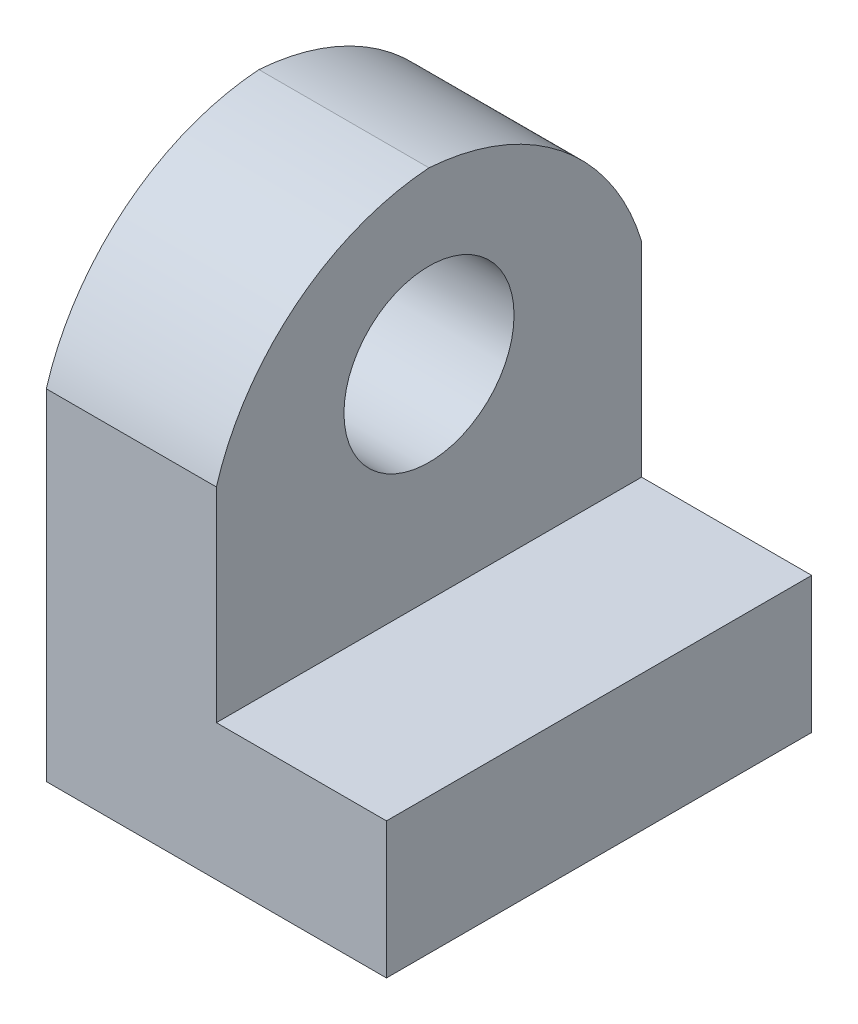
ISO-10303-21;
HEADER;
FILE_DESCRIPTION(('STEP AP214'),'2;1');
FILE_NAME('part.step','',(''),(''),'','','');
FILE_SCHEMA(('AUTOMOTIVE_DESIGN { 1 0 10303 214 1 1 1 1 }'));
ENDSEC;
DATA;
#1=APPLICATION_CONTEXT('core data for automotive mechanical design processes');
#2=APPLICATION_PROTOCOL_DEFINITION('international standard','automotive_design',2000,#1);
#3=PRODUCT_CONTEXT('',#1,'mechanical');
#4=PRODUCT('Part','Part','',(#3));
#5=PRODUCT_RELATED_PRODUCT_CATEGORY('part','',(#4));
#6=PRODUCT_DEFINITION_FORMATION('','',#4);
#7=PRODUCT_DEFINITION_CONTEXT('part definition',#1,'design');
#8=PRODUCT_DEFINITION('design','',#6,#7);
#9=PRODUCT_DEFINITION_SHAPE('','',#8);
#10=(LENGTH_UNIT() NAMED_UNIT(*) SI_UNIT(.MILLI.,.METRE.));
#11=(NAMED_UNIT(*) PLANE_ANGLE_UNIT() SI_UNIT($,.RADIAN.));
#12=(NAMED_UNIT(*) SI_UNIT($,.STERADIAN.) SOLID_ANGLE_UNIT());
#13=UNCERTAINTY_MEASURE_WITH_UNIT(LENGTH_MEASURE(1.E-05),#10,'distance_accuracy_value','');
#14=(GEOMETRIC_REPRESENTATION_CONTEXT(3) GLOBAL_UNCERTAINTY_ASSIGNED_CONTEXT((#13)) GLOBAL_UNIT_ASSIGNED_CONTEXT((#10,
#11,#12)) REPRESENTATION_CONTEXT('',''));
#15=CARTESIAN_POINT('',(0.,0.,0.));
#16=DIRECTION('',(0.,0.,1.));
#17=DIRECTION('',(1.,0.,0.));
#18=AXIS2_PLACEMENT_3D('',#15,#16,#17);
#19=CARTESIAN_POINT('',(0.,30.,0.));
#20=DIRECTION('',(1.,0.,0.));
#21=DIRECTION('',(0.,0.,-1.));
#22=AXIS2_PLACEMENT_3D('',#19,#20,#21);
#23=PLANE('',#22);
#24=CARTESIAN_POINT('',(0.,20.,12.5));
#25=DIRECTION('',(1.,0.,0.));
#26=DIRECTION('',(0.,0.,-1.));
#27=AXIS2_PLACEMENT_3D('',#24,#25,#26);
#28=CIRCLE('',#27,5.);
#29=CARTESIAN_POINT('',(0.,20.,7.5));
#30=VERTEX_POINT('',#29);
#31=EDGE_CURVE('E118',#30,#30,#28,.T.);
#32=ORIENTED_EDGE('',*,*,#31,.T.);
#33=EDGE_LOOP('',(#32));
#34=FACE_BOUND('',#33,.T.);
#35=CARTESIAN_POINT('',(0.,15.951031378761,11.5108251030088));
#36=DIRECTION('',(1.,0.,0.));
#37=DIRECTION('',(0.,0.,-1.));
#38=AXIS2_PLACEMENT_3D('',#35,#36,#37);
#39=CIRCLE('',#38,14.0837490142858);
#40=CARTESIAN_POINT('',(0.,30.,12.5));
#41=VERTEX_POINT('',#40);
#42=CARTESIAN_POINT('',(0.,20.,25.));
#43=VERTEX_POINT('',#42);
#44=EDGE_CURVE('E128',#41,#43,#39,.T.);
#45=ORIENTED_EDGE('',*,*,#44,.F.);
#46=CARTESIAN_POINT('',(0.,15.951031378761,13.4891748969912));
#47=DIRECTION('',(1.,0.,0.));
#48=DIRECTION('',(0.,0.,-1.));
#49=AXIS2_PLACEMENT_3D('',#46,#47,#48);
#50=CIRCLE('',#49,14.0837490142858);
#51=CARTESIAN_POINT('',(0.,20.,0.));
#52=VERTEX_POINT('',#51);
#53=EDGE_CURVE('E105',#41,#52,#50,.F.);
#54=ORIENTED_EDGE('',*,*,#53,.T.);
#55=DIRECTION('',(0.,-1.,0.));
#56=VECTOR('',#55,1.);
#57=CARTESIAN_POINT('',(0.,30.,0.));
#58=LINE('',#57,#56);
#59=CARTESIAN_POINT('',(0.,0.,0.));
#60=VERTEX_POINT('',#59);
#61=EDGE_CURVE('E62',#52,#60,#58,.T.);
#62=ORIENTED_EDGE('',*,*,#61,.T.);
#63=DIRECTION('',(0.,0.,1.));
#64=VECTOR('',#63,1.);
#65=CARTESIAN_POINT('',(0.,0.,0.));
#66=LINE('',#65,#64);
#67=CARTESIAN_POINT('',(0.,0.,25.));
#68=VERTEX_POINT('',#67);
#69=EDGE_CURVE('E148',#60,#68,#66,.T.);
#70=ORIENTED_EDGE('',*,*,#69,.T.);
#71=DIRECTION('',(0.,-1.,0.));
#72=VECTOR('',#71,1.);
#73=CARTESIAN_POINT('',(0.,30.,25.));
#74=LINE('',#73,#72);
#75=EDGE_CURVE('E47',#43,#68,#74,.T.);
#76=ORIENTED_EDGE('',*,*,#75,.F.);
#77=EDGE_LOOP('',(#45,#54,#62,#70,#76));
#78=FACE_BOUND('',#77,.T.);
#79=ADVANCED_FACE('F39',(#34,#78),#23,.F.);
#80=CARTESIAN_POINT('',(10.,8.,-5.));
#81=DIRECTION('',(-1.,0.,0.));
#82=DIRECTION('',(0.,0.,1.));
#83=AXIS2_PLACEMENT_3D('',#80,#81,#82);
#84=PLANE('',#83);
#85=CARTESIAN_POINT('',(10.,20.,12.5));
#86=DIRECTION('',(1.,0.,0.));
#87=DIRECTION('',(0.,0.,-1.));
#88=AXIS2_PLACEMENT_3D('',#85,#86,#87);
#89=CIRCLE('',#88,5.);
#90=CARTESIAN_POINT('',(10.,20.,7.5));
#91=VERTEX_POINT('',#90);
#92=EDGE_CURVE('E191',#91,#91,#89,.T.);
#93=ORIENTED_EDGE('',*,*,#92,.F.);
#94=EDGE_LOOP('',(#93));
#95=FACE_BOUND('',#94,.T.);
#96=DIRECTION('',(0.,-1.,0.));
#97=VECTOR('',#96,1.);
#98=CARTESIAN_POINT('',(10.,30.,0.));
#99=LINE('',#98,#97);
#100=CARTESIAN_POINT('',(10.,20.,0.));
#101=VERTEX_POINT('',#100);
#102=CARTESIAN_POINT('',(10.,8.,0.));
#103=VERTEX_POINT('',#102);
#104=EDGE_CURVE('E115',#101,#103,#99,.T.);
#105=ORIENTED_EDGE('',*,*,#104,.F.);
#106=CARTESIAN_POINT('',(10.,15.951031378761,13.4891748969912));
#107=DIRECTION('',(1.,0.,0.));
#108=DIRECTION('',(0.,0.,-1.));
#109=AXIS2_PLACEMENT_3D('',#106,#107,#108);
#110=CIRCLE('',#109,14.0837490142858);
#111=CARTESIAN_POINT('',(10.,30.,12.5));
#112=VERTEX_POINT('',#111);
#113=EDGE_CURVE('E103',#112,#101,#110,.F.);
#114=ORIENTED_EDGE('',*,*,#113,.F.);
#115=CARTESIAN_POINT('',(10.,15.951031378761,11.5108251030088));
#116=DIRECTION('',(1.,0.,0.));
#117=DIRECTION('',(0.,0.,-1.));
#118=AXIS2_PLACEMENT_3D('',#115,#116,#117);
#119=CIRCLE('',#118,14.0837490142858);
#120=CARTESIAN_POINT('',(10.,20.,25.));
#121=VERTEX_POINT('',#120);
#122=EDGE_CURVE('E108',#112,#121,#119,.T.);
#123=ORIENTED_EDGE('',*,*,#122,.T.);
#124=DIRECTION('',(0.,-1.,0.));
#125=VECTOR('',#124,1.);
#126=CARTESIAN_POINT('',(10.,8.,25.));
#127=LINE('',#126,#125);
#128=CARTESIAN_POINT('',(10.,8.,25.));
#129=VERTEX_POINT('',#128);
#130=EDGE_CURVE('E132',#121,#129,#127,.T.);
#131=ORIENTED_EDGE('',*,*,#130,.T.);
#132=DIRECTION('',(0.,0.,1.));
#133=VECTOR('',#132,1.);
#134=CARTESIAN_POINT('',(10.,8.,-5.));
#135=LINE('',#134,#133);
#136=EDGE_CURVE('E138',#103,#129,#135,.T.);
#137=ORIENTED_EDGE('',*,*,#136,.F.);
#138=EDGE_LOOP('',(#105,#114,#123,#131,#137));
#139=FACE_BOUND('',#138,.T.);
#140=ADVANCED_FACE('F112',(#95,#139),#84,.F.);
#141=CARTESIAN_POINT('',(0.,30.,25.));
#142=DIRECTION('',(0.,0.,-1.));
#143=DIRECTION('',(-1.,0.,0.));
#144=AXIS2_PLACEMENT_3D('',#141,#142,#143);
#145=PLANE('',#144);
#146=DIRECTION('',(1.,0.,0.));
#147=VECTOR('',#146,1.);
#148=CARTESIAN_POINT('',(-20.,20.,25.));
#149=LINE('',#148,#147);
#150=EDGE_CURVE('E54',#43,#121,#149,.T.);
#151=ORIENTED_EDGE('',*,*,#150,.F.);
#152=ORIENTED_EDGE('',*,*,#75,.T.);
#153=DIRECTION('',(1.,0.,0.));
#154=VECTOR('',#153,1.);
#155=CARTESIAN_POINT('',(0.,0.,25.));
#156=LINE('',#155,#154);
#157=CARTESIAN_POINT('',(20.,0.,25.));
#158=VERTEX_POINT('',#157);
#159=EDGE_CURVE('E151',#68,#158,#156,.T.);
#160=ORIENTED_EDGE('',*,*,#159,.T.);
#161=DIRECTION('',(0.,-1.,0.));
#162=VECTOR('',#161,1.);
#163=CARTESIAN_POINT('',(20.,30.,25.));
#164=LINE('',#163,#162);
#165=CARTESIAN_POINT('',(20.,8.,25.));
#166=VERTEX_POINT('',#165);
#167=EDGE_CURVE('E167',#166,#158,#164,.T.);
#168=ORIENTED_EDGE('',*,*,#167,.F.);
#169=DIRECTION('',(1.,0.,0.));
#170=VECTOR('',#169,1.);
#171=CARTESIAN_POINT('',(20.,8.,25.));
#172=LINE('',#171,#170);
#173=EDGE_CURVE('E135',#129,#166,#172,.T.);
#174=ORIENTED_EDGE('',*,*,#173,.F.);
#175=ORIENTED_EDGE('',*,*,#130,.F.);
#176=EDGE_LOOP('',(#151,#152,#160,#168,#174,#175));
#177=FACE_BOUND('',#176,.T.);
#178=ADVANCED_FACE('F173',(#177),#145,.F.);
#179=CARTESIAN_POINT('',(20.,30.,0.));
#180=DIRECTION('',(-1.,0.,0.));
#181=DIRECTION('',(0.,0.,1.));
#182=AXIS2_PLACEMENT_3D('',#179,#180,#181);
#183=PLANE('',#182);
#184=DIRECTION('',(0.,-1.,0.));
#185=VECTOR('',#184,1.);
#186=CARTESIAN_POINT('',(20.,30.,0.));
#187=LINE('',#186,#185);
#188=CARTESIAN_POINT('',(20.,8.,0.));
#189=VERTEX_POINT('',#188);
#190=CARTESIAN_POINT('',(20.,0.,0.));
#191=VERTEX_POINT('',#190);
#192=EDGE_CURVE('E164',#189,#191,#187,.T.);
#193=ORIENTED_EDGE('',*,*,#192,.F.);
#194=DIRECTION('',(0.,0.,1.));
#195=VECTOR('',#194,1.);
#196=CARTESIAN_POINT('',(20.,8.,-5.));
#197=LINE('',#196,#195);
#198=EDGE_CURVE('E139',#189,#166,#197,.T.);
#199=ORIENTED_EDGE('',*,*,#198,.T.);
#200=ORIENTED_EDGE('',*,*,#167,.T.);
#201=DIRECTION('',(0.,0.,-1.));
#202=VECTOR('',#201,1.);
#203=CARTESIAN_POINT('',(20.,0.,0.));
#204=LINE('',#203,#202);
#205=EDGE_CURVE('E155',#158,#191,#204,.T.);
#206=ORIENTED_EDGE('',*,*,#205,.T.);
#207=EDGE_LOOP('',(#193,#199,#200,#206));
#208=FACE_BOUND('',#207,.T.);
#209=ADVANCED_FACE('F202',(#208),#183,.F.);
#210=CARTESIAN_POINT('',(0.,30.,0.));
#211=DIRECTION('',(0.,0.,1.));
#212=DIRECTION('',(1.,0.,0.));
#213=AXIS2_PLACEMENT_3D('',#210,#211,#212);
#214=PLANE('',#213);
#215=ORIENTED_EDGE('',*,*,#61,.F.);
#216=DIRECTION('',(1.,0.,0.));
#217=VECTOR('',#216,1.);
#218=CARTESIAN_POINT('',(-20.,20.,0.));
#219=LINE('',#218,#217);
#220=EDGE_CURVE('E117',#52,#101,#219,.T.);
#221=ORIENTED_EDGE('',*,*,#220,.T.);
#222=ORIENTED_EDGE('',*,*,#104,.T.);
#223=DIRECTION('',(1.,0.,0.));
#224=VECTOR('',#223,1.);
#225=CARTESIAN_POINT('',(0.,7.99999999999999,0.));
#226=LINE('',#225,#224);
#227=EDGE_CURVE('E11',#103,#189,#226,.T.);
#228=ORIENTED_EDGE('',*,*,#227,.T.);
#229=ORIENTED_EDGE('',*,*,#192,.T.);
#230=DIRECTION('',(-1.,0.,0.));
#231=VECTOR('',#230,1.);
#232=CARTESIAN_POINT('',(0.,0.,0.));
#233=LINE('',#232,#231);
#234=EDGE_CURVE('E159',#191,#60,#233,.T.);
#235=ORIENTED_EDGE('',*,*,#234,.T.);
#236=EDGE_LOOP('',(#215,#221,#222,#228,#229,#235));
#237=FACE_BOUND('',#236,.T.);
#238=ADVANCED_FACE('F198',(#237),#214,.F.);
#239=CARTESIAN_POINT('',(0.,0.,0.));
#240=DIRECTION('',(0.,1.,0.));
#241=DIRECTION('',(0.,0.,1.));
#242=AXIS2_PLACEMENT_3D('',#239,#240,#241);
#243=PLANE('',#242);
#244=ORIENTED_EDGE('',*,*,#69,.F.);
#245=ORIENTED_EDGE('',*,*,#234,.F.);
#246=ORIENTED_EDGE('',*,*,#205,.F.);
#247=ORIENTED_EDGE('',*,*,#159,.F.);
#248=EDGE_LOOP('',(#244,#245,#246,#247));
#249=FACE_BOUND('',#248,.T.);
#250=ADVANCED_FACE('F178',(#249),#243,.F.);
#251=CARTESIAN_POINT('',(20.,8.,-5.));
#252=DIRECTION('',(0.,-1.,0.));
#253=DIRECTION('',(1.,0.,0.));
#254=AXIS2_PLACEMENT_3D('',#251,#252,#253);
#255=PLANE('',#254);
#256=ORIENTED_EDGE('',*,*,#136,.T.);
#257=ORIENTED_EDGE('',*,*,#173,.T.);
#258=ORIENTED_EDGE('',*,*,#198,.F.);
#259=ORIENTED_EDGE('',*,*,#227,.F.);
#260=EDGE_LOOP('',(#256,#257,#258,#259));
#261=FACE_BOUND('',#260,.T.);
#262=ADVANCED_FACE('F205',(#261),#255,.F.);
#263=CARTESIAN_POINT('',(-20.,15.951031378761,11.5108251030088));
#264=DIRECTION('',(1.,0.,0.));
#265=DIRECTION('',(0.,0.,-1.));
#266=AXIS2_PLACEMENT_3D('',#263,#264,#265);
#267=CYLINDRICAL_SURFACE('',#266,14.0837490142858);
#268=ORIENTED_EDGE('',*,*,#44,.T.);
#269=ORIENTED_EDGE('',*,*,#150,.T.);
#270=ORIENTED_EDGE('',*,*,#122,.F.);
#271=DIRECTION('',(1.,0.,0.));
#272=VECTOR('',#271,1.);
#273=CARTESIAN_POINT('',(-20.,30.,12.5));
#274=LINE('',#273,#272);
#275=EDGE_CURVE('E100',#41,#112,#274,.T.);
#276=ORIENTED_EDGE('',*,*,#275,.F.);
#277=EDGE_LOOP('',(#268,#269,#270,#276));
#278=FACE_BOUND('',#277,.T.);
#279=ADVANCED_FACE('F120',(#278),#267,.T.);
#280=CARTESIAN_POINT('',(-20.,15.951031378761,13.4891748969912));
#281=DIRECTION('',(1.,0.,0.));
#282=DIRECTION('',(0.,0.,-1.));
#283=AXIS2_PLACEMENT_3D('',#280,#281,#282);
#284=CYLINDRICAL_SURFACE('',#283,14.0837490142858);
#285=ORIENTED_EDGE('',*,*,#275,.T.);
#286=ORIENTED_EDGE('',*,*,#113,.T.);
#287=ORIENTED_EDGE('',*,*,#220,.F.);
#288=ORIENTED_EDGE('',*,*,#53,.F.);
#289=EDGE_LOOP('',(#285,#286,#287,#288));
#290=FACE_BOUND('',#289,.T.);
#291=ADVANCED_FACE('F102',(#290),#284,.T.);
#292=CARTESIAN_POINT('',(-20.,20.,12.5));
#293=DIRECTION('',(1.,0.,0.));
#294=DIRECTION('',(0.,0.,-1.));
#295=AXIS2_PLACEMENT_3D('',#292,#293,#294);
#296=CYLINDRICAL_SURFACE('',#295,5.);
#297=ORIENTED_EDGE('',*,*,#92,.T.);
#298=EDGE_LOOP('',(#297));
#299=FACE_BOUND('',#298,.T.);
#300=ORIENTED_EDGE('',*,*,#31,.F.);
#301=EDGE_LOOP('',(#300));
#302=FACE_BOUND('',#301,.T.);
#303=ADVANCED_FACE('F268',(#299,#302),#296,.F.);
#304=CLOSED_SHELL('',(#79,#140,#178,#209,#238,#250,#262,#279,#291,#303));
#305=MANIFOLD_SOLID_BREP('B2',#304);
#306=ADVANCED_BREP_SHAPE_REPRESENTATION('',(#18,#305),#14);
#307=SHAPE_DEFINITION_REPRESENTATION(#9,#306);
ENDSEC;
END-ISO-10303-21;
